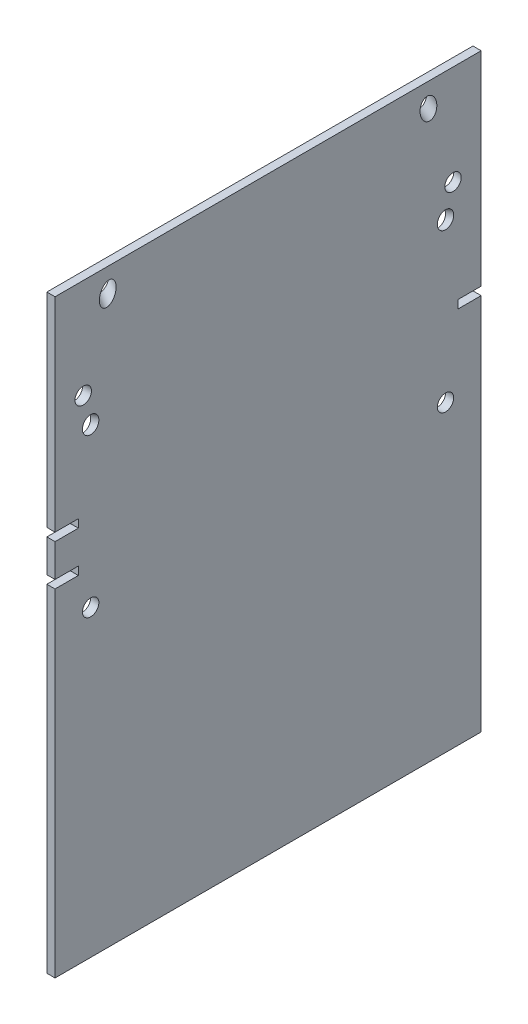
ISO-10303-21;
HEADER;
FILE_DESCRIPTION(('STEP AP214'),'2;1');
FILE_NAME('part.step','',(''),(''),'','','');
FILE_SCHEMA(('AUTOMOTIVE_DESIGN { 1 0 10303 214 1 1 1 1 }'));
ENDSEC;
DATA;
#1=APPLICATION_CONTEXT('core data for automotive mechanical design processes');
#2=APPLICATION_PROTOCOL_DEFINITION('international standard','automotive_design',2000,#1);
#3=PRODUCT_CONTEXT('',#1,'mechanical');
#4=PRODUCT('Part','Part','',(#3));
#5=PRODUCT_RELATED_PRODUCT_CATEGORY('part','',(#4));
#6=PRODUCT_DEFINITION_FORMATION('','',#4);
#7=PRODUCT_DEFINITION_CONTEXT('part definition',#1,'design');
#8=PRODUCT_DEFINITION('design','',#6,#7);
#9=PRODUCT_DEFINITION_SHAPE('','',#8);
#10=(LENGTH_UNIT() NAMED_UNIT(*) SI_UNIT(.MILLI.,.METRE.));
#11=(NAMED_UNIT(*) PLANE_ANGLE_UNIT() SI_UNIT($,.RADIAN.));
#12=(NAMED_UNIT(*) SI_UNIT($,.STERADIAN.) SOLID_ANGLE_UNIT());
#13=UNCERTAINTY_MEASURE_WITH_UNIT(LENGTH_MEASURE(1.E-05),#10,'distance_accuracy_value','');
#14=(GEOMETRIC_REPRESENTATION_CONTEXT(3) GLOBAL_UNCERTAINTY_ASSIGNED_CONTEXT((#13)) GLOBAL_UNIT_ASSIGNED_CONTEXT((#10,
#11,#12)) REPRESENTATION_CONTEXT('',''));
#15=CARTESIAN_POINT('',(0.,0.,0.));
#16=DIRECTION('',(0.,0.,1.));
#17=DIRECTION('',(1.,0.,0.));
#18=AXIS2_PLACEMENT_3D('',#15,#16,#17);
#19=CARTESIAN_POINT('',(2463.8,444.5,330.2));
#20=DIRECTION('',(0.,0.,-1.));
#21=DIRECTION('',(-1.,0.,0.));
#22=AXIS2_PLACEMENT_3D('',#19,#20,#21);
#23=PLANE('',#22);
#24=DIRECTION('',(0.,-1.,0.));
#25=VECTOR('',#24,1.);
#26=CARTESIAN_POINT('',(2463.8,444.5,330.2));
#27=LINE('',#26,#25);
#28=CARTESIAN_POINT('',(2463.8,115.8,330.2));
#29=VERTEX_POINT('',#28);
#30=CARTESIAN_POINT('',(2463.8,64.9999999999999,330.2));
#31=VERTEX_POINT('',#30);
#32=EDGE_CURVE('E189',#29,#31,#27,.T.);
#33=ORIENTED_EDGE('',*,*,#32,.T.);
#34=DIRECTION('',(1.,0.,0.));
#35=VECTOR('',#34,1.);
#36=CARTESIAN_POINT('',(2463.8,64.9999999999999,330.2));
#37=LINE('',#36,#35);
#38=CARTESIAN_POINT('',(2476.5,64.9999999999999,330.2));
#39=VERTEX_POINT('',#38);
#40=EDGE_CURVE('E332',#31,#39,#37,.T.);
#41=ORIENTED_EDGE('',*,*,#40,.T.);
#42=DIRECTION('',(0.,-1.,0.));
#43=VECTOR('',#42,1.);
#44=CARTESIAN_POINT('',(2476.5,444.5,330.2));
#45=LINE('',#44,#43);
#46=CARTESIAN_POINT('',(2476.5,115.8,330.2));
#47=VERTEX_POINT('',#46);
#48=EDGE_CURVE('E170',#47,#39,#45,.T.);
#49=ORIENTED_EDGE('',*,*,#48,.F.);
#50=DIRECTION('',(-1.,0.,0.));
#51=VECTOR('',#50,1.);
#52=CARTESIAN_POINT('',(2463.8,115.8,330.2));
#53=LINE('',#52,#51);
#54=EDGE_CURVE('E299',#47,#29,#53,.T.);
#55=ORIENTED_EDGE('',*,*,#54,.T.);
#56=EDGE_LOOP('',(#33,#41,#49,#55));
#57=FACE_BOUND('',#56,.T.);
#58=ADVANCED_FACE('F37',(#57),#23,.F.);
#59=CARTESIAN_POINT('',(2463.8,444.5,-330.2));
#60=DIRECTION('',(0.,0.,1.));
#61=DIRECTION('',(1.,0.,0.));
#62=AXIS2_PLACEMENT_3D('',#59,#60,#61);
#63=PLANE('',#62);
#64=DIRECTION('',(0.,-1.,0.));
#65=VECTOR('',#64,1.);
#66=CARTESIAN_POINT('',(2463.8,444.5,-330.2));
#67=LINE('',#66,#65);
#68=CARTESIAN_POINT('',(2463.8,115.8,-330.2));
#69=VERTEX_POINT('',#68);
#70=CARTESIAN_POINT('',(2463.8,-469.9,-330.2));
#71=VERTEX_POINT('',#70);
#72=EDGE_CURVE('E258',#69,#71,#67,.T.);
#73=ORIENTED_EDGE('',*,*,#72,.F.);
#74=DIRECTION('',(1.,0.,0.));
#75=VECTOR('',#74,1.);
#76=CARTESIAN_POINT('',(2463.8,115.8,-330.2));
#77=LINE('',#76,#75);
#78=CARTESIAN_POINT('',(2476.5,115.8,-330.2));
#79=VERTEX_POINT('',#78);
#80=EDGE_CURVE('E230',#69,#79,#77,.T.);
#81=ORIENTED_EDGE('',*,*,#80,.T.);
#82=DIRECTION('',(0.,-1.,0.));
#83=VECTOR('',#82,1.);
#84=CARTESIAN_POINT('',(2476.5,444.5,-330.2));
#85=LINE('',#84,#83);
#86=CARTESIAN_POINT('',(2476.5,-469.9,-330.2));
#87=VERTEX_POINT('',#86);
#88=EDGE_CURVE('E256',#79,#87,#85,.T.);
#89=ORIENTED_EDGE('',*,*,#88,.T.);
#90=DIRECTION('',(-1.,0.,0.));
#91=VECTOR('',#90,1.);
#92=CARTESIAN_POINT('',(2463.8,-469.9,-330.2));
#93=LINE('',#92,#91);
#94=EDGE_CURVE('E180',#87,#71,#93,.T.);
#95=ORIENTED_EDGE('',*,*,#94,.T.);
#96=EDGE_LOOP('',(#73,#81,#89,#95));
#97=FACE_BOUND('',#96,.T.);
#98=ADVANCED_FACE('F353',(#97),#63,.F.);
#99=CARTESIAN_POINT('',(2463.8,444.5,330.2));
#100=VERTEX_POINT('',#99);
#101=CARTESIAN_POINT('',(2463.8,128.5,330.2));
#102=VERTEX_POINT('',#101);
#103=EDGE_CURVE('E186',#100,#102,#27,.T.);
#104=ORIENTED_EDGE('',*,*,#103,.T.);
#105=DIRECTION('',(1.,0.,0.));
#106=VECTOR('',#105,1.);
#107=CARTESIAN_POINT('',(2463.8,128.5,330.2));
#108=LINE('',#107,#106);
#109=CARTESIAN_POINT('',(2476.5,128.5,330.2));
#110=VERTEX_POINT('',#109);
#111=EDGE_CURVE('E267',#102,#110,#108,.T.);
#112=ORIENTED_EDGE('',*,*,#111,.T.);
#113=CARTESIAN_POINT('',(2476.5,444.5,330.2));
#114=VERTEX_POINT('',#113);
#115=EDGE_CURVE('E176',#114,#110,#45,.T.);
#116=ORIENTED_EDGE('',*,*,#115,.F.);
#117=DIRECTION('',(1.,0.,0.));
#118=VECTOR('',#117,1.);
#119=CARTESIAN_POINT('',(2463.8,444.5,330.2));
#120=LINE('',#119,#118);
#121=EDGE_CURVE('E273',#100,#114,#120,.T.);
#122=ORIENTED_EDGE('',*,*,#121,.F.);
#123=EDGE_LOOP('',(#104,#112,#116,#122));
#124=FACE_BOUND('',#123,.T.);
#125=ADVANCED_FACE('F355',(#124),#23,.F.);
#126=CARTESIAN_POINT('',(2463.8,444.5,-330.2));
#127=DIRECTION('',(1.,0.,0.));
#128=DIRECTION('',(0.,0.,-1.));
#129=AXIS2_PLACEMENT_3D('',#126,#127,#128);
#130=PLANE('',#129);
#131=DIRECTION('',(0.,1.,0.));
#132=VECTOR('',#131,1.);
#133=CARTESIAN_POINT('',(2463.8,52.3,294.05));
#134=LINE('',#133,#132);
#135=CARTESIAN_POINT('',(2463.8,52.3,294.05));
#136=VERTEX_POINT('',#135);
#137=CARTESIAN_POINT('',(2463.8,65.,294.05));
#138=VERTEX_POINT('',#137);
#139=EDGE_CURVE('E163',#136,#138,#134,.T.);
#140=ORIENTED_EDGE('',*,*,#139,.T.);
#141=DIRECTION('',(0.,0.,1.));
#142=VECTOR('',#141,1.);
#143=CARTESIAN_POINT('',(2463.8,64.9999999999999,-330.2));
#144=LINE('',#143,#142);
#145=EDGE_CURVE('E162',#138,#31,#144,.T.);
#146=ORIENTED_EDGE('',*,*,#145,.T.);
#147=ORIENTED_EDGE('',*,*,#32,.F.);
#148=DIRECTION('',(0.,0.,-1.));
#149=VECTOR('',#148,1.);
#150=CARTESIAN_POINT('',(2463.8,115.8,-330.2));
#151=LINE('',#150,#149);
#152=CARTESIAN_POINT('',(2463.8,115.8,294.05));
#153=VERTEX_POINT('',#152);
#154=EDGE_CURVE('E296',#29,#153,#151,.T.);
#155=ORIENTED_EDGE('',*,*,#154,.T.);
#156=DIRECTION('',(0.,1.,0.));
#157=VECTOR('',#156,1.);
#158=CARTESIAN_POINT('',(2463.8,115.8,294.05));
#159=LINE('',#158,#157);
#160=CARTESIAN_POINT('',(2463.8,128.5,294.05));
#161=VERTEX_POINT('',#160);
#162=EDGE_CURVE('E301',#153,#161,#159,.T.);
#163=ORIENTED_EDGE('',*,*,#162,.T.);
#164=DIRECTION('',(0.,0.,1.));
#165=VECTOR('',#164,1.);
#166=CARTESIAN_POINT('',(2463.8,128.5,-330.2));
#167=LINE('',#166,#165);
#168=EDGE_CURVE('E265',#161,#102,#167,.T.);
#169=ORIENTED_EDGE('',*,*,#168,.T.);
#170=ORIENTED_EDGE('',*,*,#103,.F.);
#171=DIRECTION('',(0.,0.,1.));
#172=VECTOR('',#171,1.);
#173=CARTESIAN_POINT('',(2463.8,444.5,-330.2));
#174=LINE('',#173,#172);
#175=CARTESIAN_POINT('',(2463.8,444.5,-330.2));
#176=VERTEX_POINT('',#175);
#177=EDGE_CURVE('E275',#176,#100,#174,.T.);
#178=ORIENTED_EDGE('',*,*,#177,.F.);
#179=CARTESIAN_POINT('',(2463.8,128.5,-330.2));
#180=VERTEX_POINT('',#179);
#181=EDGE_CURVE('E247',#176,#180,#67,.T.);
#182=ORIENTED_EDGE('',*,*,#181,.T.);
#183=DIRECTION('',(0.,0.,1.));
#184=VECTOR('',#183,1.);
#185=CARTESIAN_POINT('',(2463.8,128.5,-330.2));
#186=LINE('',#185,#184);
#187=CARTESIAN_POINT('',(2463.8,128.5,-294.050000000001));
#188=VERTEX_POINT('',#187);
#189=EDGE_CURVE('E60',#180,#188,#186,.T.);
#190=ORIENTED_EDGE('',*,*,#189,.T.);
#191=DIRECTION('',(0.,-1.,0.));
#192=VECTOR('',#191,1.);
#193=CARTESIAN_POINT('',(2463.8,128.5,-294.050000000001));
#194=LINE('',#193,#192);
#195=CARTESIAN_POINT('',(2463.8,115.8,-294.050000000001));
#196=VERTEX_POINT('',#195);
#197=EDGE_CURVE('E320',#188,#196,#194,.T.);
#198=ORIENTED_EDGE('',*,*,#197,.T.);
#199=DIRECTION('',(0.,0.,-1.));
#200=VECTOR('',#199,1.);
#201=CARTESIAN_POINT('',(2463.8,115.8,-330.2));
#202=LINE('',#201,#200);
#203=EDGE_CURVE('E305',#196,#69,#202,.T.);
#204=ORIENTED_EDGE('',*,*,#203,.T.);
#205=ORIENTED_EDGE('',*,*,#72,.T.);
#206=DIRECTION('',(0.,0.,1.));
#207=VECTOR('',#206,1.);
#208=CARTESIAN_POINT('',(2463.8,-469.9,-330.2));
#209=LINE('',#208,#207);
#210=CARTESIAN_POINT('',(2463.8,-469.9,330.2));
#211=VERTEX_POINT('',#210);
#212=EDGE_CURVE('E262',#71,#211,#209,.T.);
#213=ORIENTED_EDGE('',*,*,#212,.T.);
#214=CARTESIAN_POINT('',(2463.8,52.3,330.2));
#215=VERTEX_POINT('',#214);
#216=EDGE_CURVE('E190',#215,#211,#27,.T.);
#217=ORIENTED_EDGE('',*,*,#216,.F.);
#218=DIRECTION('',(0.,0.,-1.));
#219=VECTOR('',#218,1.);
#220=CARTESIAN_POINT('',(2463.8,52.3,-330.2));
#221=LINE('',#220,#219);
#222=EDGE_CURVE('E334',#215,#136,#221,.T.);
#223=ORIENTED_EDGE('',*,*,#222,.T.);
#224=EDGE_LOOP('',(#140,#146,#147,#155,#163,#169,#170,#178,#182,#190,#198,#204,#205,#213,#217,#223));
#225=FACE_BOUND('',#224,.T.);
#226=CARTESIAN_POINT('',(2463.8,240.627500000009,-275.000000000001));
#227=DIRECTION('',(1.,0.,0.));
#228=DIRECTION('',(0.,1.,0.));
#229=AXIS2_PLACEMENT_3D('',#226,#227,#228);
#230=ELLIPSE('',#229,13.5086829136855,12.7);
#231=CARTESIAN_POINT('',(2463.8,254.136182913695,-275.000000000001));
#232=VERTEX_POINT('',#231);
#233=EDGE_CURVE('E204',#232,#232,#230,.F.);
#234=ORIENTED_EDGE('',*,*,#233,.F.);
#235=EDGE_LOOP('',(#234));
#236=FACE_BOUND('',#235,.T.);
#237=CARTESIAN_POINT('',(2463.8,-7.12133119048504E-13,-275.000000000001));
#238=DIRECTION('',(1.,0.,0.));
#239=DIRECTION('',(0.,0.,-1.));
#240=AXIS2_PLACEMENT_3D('',#237,#238,#239);
#241=CIRCLE('',#240,12.7);
#242=CARTESIAN_POINT('',(2463.8,-7.12133119048504E-13,-287.700000000001));
#243=VERTEX_POINT('',#242);
#244=EDGE_CURVE('E208',#243,#243,#241,.F.);
#245=ORIENTED_EDGE('',*,*,#244,.F.);
#246=EDGE_LOOP('',(#245));
#247=FACE_BOUND('',#246,.T.);
#248=CARTESIAN_POINT('',(2463.8,289.999999999994,-287.768749999998));
#249=DIRECTION('',(1.,0.,0.));
#250=DIRECTION('',(0.,-1.68753899743025E-13,-1.));
#251=AXIS2_PLACEMENT_3D('',#248,#249,#250);
#252=ELLIPSE('',#251,12.7556884522406,12.7);
#253=CARTESIAN_POINT('',(2463.8,289.999999999991,-300.524438452238));
#254=VERTEX_POINT('',#253);
#255=EDGE_CURVE('E212',#254,#254,#252,.F.);
#256=ORIENTED_EDGE('',*,*,#255,.F.);
#257=EDGE_LOOP('',(#256));
#258=FACE_BOUND('',#257,.T.);
#259=CARTESIAN_POINT('',(2463.8,419.804647774969,-245.782156472755));
#260=DIRECTION('',(1.,0.,0.));
#261=DIRECTION('',(0.,0.975590762994734,0.219596591866432));
#262=AXIS2_PLACEMENT_3D('',#259,#260,#261);
#263=ELLIPSE('',#262,17.7541873688823,12.7000000000001);
#264=CARTESIAN_POINT('',(2463.8,437.125468976528,-241.88339743519));
#265=VERTEX_POINT('',#264);
#266=EDGE_CURVE('E216',#265,#265,#263,.F.);
#267=ORIENTED_EDGE('',*,*,#266,.F.);
#268=EDGE_LOOP('',(#267));
#269=FACE_BOUND('',#268,.T.);
#270=CARTESIAN_POINT('',(2463.8,419.804647774969,245.782156472754));
#271=DIRECTION('',(1.,0.,0.));
#272=DIRECTION('',(0.,-0.975590762994734,0.219596591866431));
#273=AXIS2_PLACEMENT_3D('',#270,#271,#272);
#274=ELLIPSE('',#273,17.7541873688822,12.7);
#275=CARTESIAN_POINT('',(2463.8,402.48382657341,249.680915510319));
#276=VERTEX_POINT('',#275);
#277=EDGE_CURVE('E220',#276,#276,#274,.F.);
#278=ORIENTED_EDGE('',*,*,#277,.F.);
#279=EDGE_LOOP('',(#278));
#280=FACE_BOUND('',#279,.T.);
#281=CARTESIAN_POINT('',(2463.8,240.627500000009,275.));
#282=DIRECTION('',(1.,0.,0.));
#283=DIRECTION('',(0.,-1.,0.));
#284=AXIS2_PLACEMENT_3D('',#281,#282,#283);
#285=ELLIPSE('',#284,13.5086829136855,12.7);
#286=CARTESIAN_POINT('',(2463.8,227.118817086323,275.));
#287=VERTEX_POINT('',#286);
#288=EDGE_CURVE('E203',#287,#287,#285,.F.);
#289=ORIENTED_EDGE('',*,*,#288,.F.);
#290=EDGE_LOOP('',(#289));
#291=FACE_BOUND('',#290,.T.);
#292=CARTESIAN_POINT('',(2463.8,-4.18286707223905E-12,275.));
#293=DIRECTION('',(1.,0.,0.));
#294=DIRECTION('',(0.,0.,-1.));
#295=AXIS2_PLACEMENT_3D('',#292,#293,#294);
#296=CIRCLE('',#295,12.7);
#297=CARTESIAN_POINT('',(2463.8,-4.18286707223905E-12,262.3));
#298=VERTEX_POINT('',#297);
#299=EDGE_CURVE('E199',#298,#298,#296,.F.);
#300=ORIENTED_EDGE('',*,*,#299,.F.);
#301=EDGE_LOOP('',(#300));
#302=FACE_BOUND('',#301,.T.);
#303=CARTESIAN_POINT('',(2463.8,289.999999999994,287.768749999997));
#304=DIRECTION('',(1.,0.,0.));
#305=DIRECTION('',(0.,-1.70234197109192E-13,1.));
#306=AXIS2_PLACEMENT_3D('',#303,#304,#305);
#307=ELLIPSE('',#306,12.7556884522406,12.7);
#308=CARTESIAN_POINT('',(2463.8,289.999999999991,300.524438452237));
#309=VERTEX_POINT('',#308);
#310=EDGE_CURVE('E194',#309,#309,#307,.F.);
#311=ORIENTED_EDGE('',*,*,#310,.F.);
#312=EDGE_LOOP('',(#311));
#313=FACE_BOUND('',#312,.T.);
#314=ADVANCED_FACE('F39',(#225,#236,#247,#258,#269,#280,#291,#302,#313),#130,.F.);
#315=CARTESIAN_POINT('',(2476.5,52.3,330.2));
#316=VERTEX_POINT('',#315);
#317=CARTESIAN_POINT('',(2476.5,-469.9,330.2));
#318=VERTEX_POINT('',#317);
#319=EDGE_CURVE('E177',#316,#318,#45,.T.);
#320=ORIENTED_EDGE('',*,*,#319,.F.);
#321=DIRECTION('',(-1.,0.,0.));
#322=VECTOR('',#321,1.);
#323=CARTESIAN_POINT('',(2463.8,52.3,330.2));
#324=LINE('',#323,#322);
#325=EDGE_CURVE('E239',#316,#215,#324,.T.);
#326=ORIENTED_EDGE('',*,*,#325,.T.);
#327=ORIENTED_EDGE('',*,*,#216,.T.);
#328=DIRECTION('',(1.,0.,0.));
#329=VECTOR('',#328,1.);
#330=CARTESIAN_POINT('',(2463.8,-469.9,330.2));
#331=LINE('',#330,#329);
#332=EDGE_CURVE('E242',#211,#318,#331,.T.);
#333=ORIENTED_EDGE('',*,*,#332,.T.);
#334=EDGE_LOOP('',(#320,#326,#327,#333));
#335=FACE_BOUND('',#334,.T.);
#336=ADVANCED_FACE('F238',(#335),#23,.F.);
#337=CARTESIAN_POINT('',(2476.5,444.5,-330.2));
#338=DIRECTION('',(-1.,0.,0.));
#339=DIRECTION('',(0.,0.,1.));
#340=AXIS2_PLACEMENT_3D('',#337,#338,#339);
#341=PLANE('',#340);
#342=DIRECTION('',(0.,1.,0.));
#343=VECTOR('',#342,1.);
#344=CARTESIAN_POINT('',(2476.5,52.3,294.05));
#345=LINE('',#344,#343);
#346=CARTESIAN_POINT('',(2476.5,52.3,294.05));
#347=VERTEX_POINT('',#346);
#348=CARTESIAN_POINT('',(2476.5,65.,294.05));
#349=VERTEX_POINT('',#348);
#350=EDGE_CURVE('E150',#347,#349,#345,.T.);
#351=ORIENTED_EDGE('',*,*,#350,.F.);
#352=DIRECTION('',(0.,0.,1.));
#353=VECTOR('',#352,1.);
#354=CARTESIAN_POINT('',(2476.5,52.3,-330.2));
#355=LINE('',#354,#353);
#356=EDGE_CURVE('E45',#347,#316,#355,.T.);
#357=ORIENTED_EDGE('',*,*,#356,.T.);
#358=ORIENTED_EDGE('',*,*,#319,.T.);
#359=DIRECTION('',(0.,0.,-1.));
#360=VECTOR('',#359,1.);
#361=CARTESIAN_POINT('',(2476.5,-469.9,-330.2));
#362=LINE('',#361,#360);
#363=EDGE_CURVE('E181',#318,#87,#362,.T.);
#364=ORIENTED_EDGE('',*,*,#363,.T.);
#365=ORIENTED_EDGE('',*,*,#88,.F.);
#366=DIRECTION('',(0.,0.,1.));
#367=VECTOR('',#366,1.);
#368=CARTESIAN_POINT('',(2476.5,115.8,-330.2));
#369=LINE('',#368,#367);
#370=CARTESIAN_POINT('',(2476.5,115.8,-294.050000000001));
#371=VERTEX_POINT('',#370);
#372=EDGE_CURVE('E313',#79,#371,#369,.T.);
#373=ORIENTED_EDGE('',*,*,#372,.T.);
#374=DIRECTION('',(0.,-1.,0.));
#375=VECTOR('',#374,1.);
#376=CARTESIAN_POINT('',(2476.5,128.5,-294.050000000001));
#377=LINE('',#376,#375);
#378=CARTESIAN_POINT('',(2476.5,128.5,-294.050000000001));
#379=VERTEX_POINT('',#378);
#380=EDGE_CURVE('E324',#379,#371,#377,.T.);
#381=ORIENTED_EDGE('',*,*,#380,.F.);
#382=DIRECTION('',(0.,0.,-1.));
#383=VECTOR('',#382,1.);
#384=CARTESIAN_POINT('',(2476.5,128.5,-330.2));
#385=LINE('',#384,#383);
#386=CARTESIAN_POINT('',(2476.5,128.5,-330.2));
#387=VERTEX_POINT('',#386);
#388=EDGE_CURVE('E317',#379,#387,#385,.T.);
#389=ORIENTED_EDGE('',*,*,#388,.T.);
#390=CARTESIAN_POINT('',(2476.5,444.5,-330.2));
#391=VERTEX_POINT('',#390);
#392=EDGE_CURVE('E184',#391,#387,#85,.T.);
#393=ORIENTED_EDGE('',*,*,#392,.F.);
#394=DIRECTION('',(0.,0.,-1.));
#395=VECTOR('',#394,1.);
#396=CARTESIAN_POINT('',(2476.5,444.5,-330.2));
#397=LINE('',#396,#395);
#398=EDGE_CURVE('E271',#114,#391,#397,.T.);
#399=ORIENTED_EDGE('',*,*,#398,.F.);
#400=ORIENTED_EDGE('',*,*,#115,.T.);
#401=DIRECTION('',(0.,0.,-1.));
#402=VECTOR('',#401,1.);
#403=CARTESIAN_POINT('',(2476.5,128.5,-330.2));
#404=LINE('',#403,#402);
#405=CARTESIAN_POINT('',(2476.5,128.5,294.05));
#406=VERTEX_POINT('',#405);
#407=EDGE_CURVE('E225',#110,#406,#404,.T.);
#408=ORIENTED_EDGE('',*,*,#407,.T.);
#409=DIRECTION('',(0.,1.,0.));
#410=VECTOR('',#409,1.);
#411=CARTESIAN_POINT('',(2476.5,115.8,294.05));
#412=LINE('',#411,#410);
#413=CARTESIAN_POINT('',(2476.5,115.8,294.05));
#414=VERTEX_POINT('',#413);
#415=EDGE_CURVE('E304',#414,#406,#412,.T.);
#416=ORIENTED_EDGE('',*,*,#415,.F.);
#417=DIRECTION('',(0.,0.,1.));
#418=VECTOR('',#417,1.);
#419=CARTESIAN_POINT('',(2476.5,115.8,-330.2));
#420=LINE('',#419,#418);
#421=EDGE_CURVE('E173',#414,#47,#420,.T.);
#422=ORIENTED_EDGE('',*,*,#421,.T.);
#423=ORIENTED_EDGE('',*,*,#48,.T.);
#424=DIRECTION('',(0.,0.,-1.));
#425=VECTOR('',#424,1.);
#426=CARTESIAN_POINT('',(2476.5,64.9999999999999,-330.2));
#427=LINE('',#426,#425);
#428=EDGE_CURVE('E11',#39,#349,#427,.T.);
#429=ORIENTED_EDGE('',*,*,#428,.T.);
#430=EDGE_LOOP('',(#351,#357,#358,#364,#365,#373,#381,#389,#393,#399,#400,#408,#416,#422,#423,#429));
#431=FACE_BOUND('',#430,.T.);
#432=CARTESIAN_POINT('',(2476.5,245.231250000009,-275.000000000001));
#433=DIRECTION('',(-1.,0.,0.));
#434=DIRECTION('',(0.,1.,0.));
#435=AXIS2_PLACEMENT_3D('',#432,#433,#434);
#436=ELLIPSE('',#435,13.5086829136855,12.7);
#437=CARTESIAN_POINT('',(2476.5,258.739932913695,-275.000000000001));
#438=VERTEX_POINT('',#437);
#439=EDGE_CURVE('E207',#438,#438,#436,.F.);
#440=ORIENTED_EDGE('',*,*,#439,.F.);
#441=EDGE_LOOP('',(#440));
#442=FACE_BOUND('',#441,.T.);
#443=CARTESIAN_POINT('',(2476.5,-6.45730104276708E-13,-275.000000000001));
#444=DIRECTION('',(-1.,0.,0.));
#445=DIRECTION('',(0.,0.,1.));
#446=AXIS2_PLACEMENT_3D('',#443,#444,#445);
#447=CIRCLE('',#446,12.7);
#448=CARTESIAN_POINT('',(2476.5,-6.45730104276708E-13,-262.300000000001));
#449=VERTEX_POINT('',#448);
#450=EDGE_CURVE('E211',#449,#449,#447,.F.);
#451=ORIENTED_EDGE('',*,*,#450,.F.);
#452=EDGE_LOOP('',(#451));
#453=FACE_BOUND('',#452,.T.);
#454=CARTESIAN_POINT('',(2476.5,289.999999999994,-286.578124999997));
#455=DIRECTION('',(-1.,0.,0.));
#456=DIRECTION('',(0.,-1.68753899743025E-13,-1.));
#457=AXIS2_PLACEMENT_3D('',#454,#455,#456);
#458=ELLIPSE('',#457,12.7556884522406,12.7);
#459=CARTESIAN_POINT('',(2476.5,289.999999999992,-299.333813452238));
#460=VERTEX_POINT('',#459);
#461=EDGE_CURVE('E215',#460,#460,#458,.F.);
#462=ORIENTED_EDGE('',*,*,#461,.F.);
#463=EDGE_LOOP('',(#462));
#464=FACE_BOUND('',#463,.T.);
#465=CARTESIAN_POINT('',(2476.5,407.700983848811,-248.506580942624));
#466=DIRECTION('',(-1.,0.,0.));
#467=DIRECTION('',(0.,0.975590762994734,0.219596591866432));
#468=AXIS2_PLACEMENT_3D('',#465,#466,#467);
#469=ELLIPSE('',#468,17.7541873688823,12.7000000000001);
#470=CARTESIAN_POINT('',(2476.5,425.021805050371,-244.607821905059));
#471=VERTEX_POINT('',#470);
#472=EDGE_CURVE('E219',#471,#471,#469,.F.);
#473=ORIENTED_EDGE('',*,*,#472,.F.);
#474=EDGE_LOOP('',(#473));
#475=FACE_BOUND('',#474,.T.);
#476=CARTESIAN_POINT('',(2476.5,407.700983848812,248.506580942623));
#477=DIRECTION('',(-1.,0.,0.));
#478=DIRECTION('',(0.,-0.975590762994734,0.219596591866431));
#479=AXIS2_PLACEMENT_3D('',#476,#477,#478);
#480=ELLIPSE('',#479,17.7541873688822,12.7);
#481=CARTESIAN_POINT('',(2476.5,390.380162647253,252.405339980188));
#482=VERTEX_POINT('',#481);
#483=EDGE_CURVE('E223',#482,#482,#480,.F.);
#484=ORIENTED_EDGE('',*,*,#483,.F.);
#485=EDGE_LOOP('',(#484));
#486=FACE_BOUND('',#485,.T.);
#487=CARTESIAN_POINT('',(2476.5,245.231250000009,275.));
#488=DIRECTION('',(-1.,0.,0.));
#489=DIRECTION('',(0.,-1.,0.));
#490=AXIS2_PLACEMENT_3D('',#487,#488,#489);
#491=ELLIPSE('',#490,13.5086829136855,12.7);
#492=CARTESIAN_POINT('',(2476.5,231.722567086323,275.));
#493=VERTEX_POINT('',#492);
#494=EDGE_CURVE('E200',#493,#493,#491,.F.);
#495=ORIENTED_EDGE('',*,*,#494,.F.);
#496=EDGE_LOOP('',(#495));
#497=FACE_BOUND('',#496,.T.);
#498=CARTESIAN_POINT('',(2476.5,-4.18286707223905E-12,275.));
#499=DIRECTION('',(-1.,0.,0.));
#500=DIRECTION('',(0.,0.,1.));
#501=AXIS2_PLACEMENT_3D('',#498,#499,#500);
#502=CIRCLE('',#501,12.7);
#503=CARTESIAN_POINT('',(2476.5,-4.18286707223905E-12,287.7));
#504=VERTEX_POINT('',#503);
#505=EDGE_CURVE('E196',#504,#504,#502,.F.);
#506=ORIENTED_EDGE('',*,*,#505,.F.);
#507=EDGE_LOOP('',(#506));
#508=FACE_BOUND('',#507,.T.);
#509=CARTESIAN_POINT('',(2476.5,289.999999999994,286.578124999997));
#510=DIRECTION('',(-1.,0.,0.));
#511=DIRECTION('',(0.,-1.70234197109192E-13,1.));
#512=AXIS2_PLACEMENT_3D('',#509,#510,#511);
#513=ELLIPSE('',#512,12.7556884522406,12.7);
#514=CARTESIAN_POINT('',(2476.5,289.999999999992,299.333813452237));
#515=VERTEX_POINT('',#514);
#516=EDGE_CURVE('E191',#515,#515,#513,.F.);
#517=ORIENTED_EDGE('',*,*,#516,.F.);
#518=EDGE_LOOP('',(#517));
#519=FACE_BOUND('',#518,.T.);
#520=ADVANCED_FACE('F166',(#431,#442,#453,#464,#475,#486,#497,#508,#519),#341,.F.);
#521=ORIENTED_EDGE('',*,*,#392,.T.);
#522=DIRECTION('',(-1.,0.,0.));
#523=VECTOR('',#522,1.);
#524=CARTESIAN_POINT('',(2463.8,128.5,-330.2));
#525=LINE('',#524,#523);
#526=EDGE_CURVE('E228',#387,#180,#525,.T.);
#527=ORIENTED_EDGE('',*,*,#526,.T.);
#528=ORIENTED_EDGE('',*,*,#181,.F.);
#529=DIRECTION('',(-1.,0.,0.));
#530=VECTOR('',#529,1.);
#531=CARTESIAN_POINT('',(2463.8,444.5,-330.2));
#532=LINE('',#531,#530);
#533=EDGE_CURVE('E195',#391,#176,#532,.T.);
#534=ORIENTED_EDGE('',*,*,#533,.F.);
#535=EDGE_LOOP('',(#521,#527,#528,#534));
#536=FACE_BOUND('',#535,.T.);
#537=ADVANCED_FACE('F361',(#536),#63,.F.);
#538=CARTESIAN_POINT('',(0.,444.5,0.));
#539=DIRECTION('',(0.,1.,0.));
#540=DIRECTION('',(0.,0.,1.));
#541=AXIS2_PLACEMENT_3D('',#538,#539,#540);
#542=PLANE('',#541);
#543=ORIENTED_EDGE('',*,*,#177,.T.);
#544=ORIENTED_EDGE('',*,*,#121,.T.);
#545=ORIENTED_EDGE('',*,*,#398,.T.);
#546=ORIENTED_EDGE('',*,*,#533,.T.);
#547=EDGE_LOOP('',(#543,#544,#545,#546));
#548=FACE_BOUND('',#547,.T.);
#549=ADVANCED_FACE('F399',(#548),#542,.T.);
#550=CARTESIAN_POINT('',(0.,-469.9,0.));
#551=DIRECTION('',(0.,1.,0.));
#552=DIRECTION('',(0.,0.,1.));
#553=AXIS2_PLACEMENT_3D('',#550,#551,#552);
#554=PLANE('',#553);
#555=ORIENTED_EDGE('',*,*,#212,.F.);
#556=ORIENTED_EDGE('',*,*,#94,.F.);
#557=ORIENTED_EDGE('',*,*,#363,.F.);
#558=ORIENTED_EDGE('',*,*,#332,.F.);
#559=EDGE_LOOP('',(#555,#556,#557,#558));
#560=FACE_BOUND('',#559,.T.);
#561=ADVANCED_FACE('F250',(#560),#554,.F.);
#562=CARTESIAN_POINT('',(2599.99999999996,289.999999999996,275.));
#563=DIRECTION('',(-0.995634226059288,0.,0.0933407086930576));
#564=DIRECTION('',(0.0933407086930577,0.,0.995634226059288));
#565=AXIS2_PLACEMENT_3D('',#562,#563,#564);
#566=CYLINDRICAL_SURFACE('',#565,12.7);
#567=ORIENTED_EDGE('',*,*,#516,.T.);
#568=EDGE_LOOP('',(#567));
#569=FACE_BOUND('',#568,.T.);
#570=ORIENTED_EDGE('',*,*,#310,.T.);
#571=EDGE_LOOP('',(#570));
#572=FACE_BOUND('',#571,.T.);
#573=ADVANCED_FACE('F496',(#569,#572),#566,.F.);
#574=CARTESIAN_POINT('',(2599.99999999996,-4.18286707223905E-12,275.));
#575=DIRECTION('',(-1.,0.,0.));
#576=DIRECTION('',(0.,0.,1.));
#577=AXIS2_PLACEMENT_3D('',#574,#575,#576);
#578=CYLINDRICAL_SURFACE('',#577,12.7);
#579=ORIENTED_EDGE('',*,*,#505,.T.);
#580=EDGE_LOOP('',(#579));
#581=FACE_BOUND('',#580,.T.);
#582=ORIENTED_EDGE('',*,*,#299,.T.);
#583=EDGE_LOOP('',(#582));
#584=FACE_BOUND('',#583,.T.);
#585=ADVANCED_FACE('F505',(#581,#584),#578,.F.);
#586=CARTESIAN_POINT('',(2599.99999999996,289.999999999996,275.));
#587=DIRECTION('',(-0.940136065162483,-0.3407993236214,0.));
#588=DIRECTION('',(0.3407993236214,-0.940136065162483,0.));
#589=AXIS2_PLACEMENT_3D('',#586,#587,#588);
#590=CYLINDRICAL_SURFACE('',#589,12.7);
#591=ORIENTED_EDGE('',*,*,#494,.T.);
#592=EDGE_LOOP('',(#591));
#593=FACE_BOUND('',#592,.T.);
#594=ORIENTED_EDGE('',*,*,#288,.T.);
#595=EDGE_LOOP('',(#594));
#596=FACE_BOUND('',#595,.T.);
#597=ADVANCED_FACE('F515',(#593,#596),#590,.F.);
#598=CARTESIAN_POINT('',(1799.99999999996,1052.43552290753,103.38271055945));
#599=DIRECTION('',(0.715324206967608,-0.681735732234708,0.153452501838741));
#600=DIRECTION('',(0.689906973200086,0.723898037246887,0.));
#601=AXIS2_PLACEMENT_3D('',#598,#599,#600);
#602=CYLINDRICAL_SURFACE('',#601,12.7);
#603=ORIENTED_EDGE('',*,*,#483,.T.);
#604=EDGE_LOOP('',(#603));
#605=FACE_BOUND('',#604,.T.);
#606=ORIENTED_EDGE('',*,*,#277,.T.);
#607=EDGE_LOOP('',(#606));
#608=FACE_BOUND('',#607,.T.);
#609=ADVANCED_FACE('F525',(#605,#608),#602,.F.);
#610=CARTESIAN_POINT('',(2599.99999999996,289.999999999996,-275.000000000001));
#611=DIRECTION('',(-0.715324206967608,0.681735732234708,0.153452501838741));
#612=DIRECTION('',(-0.689906973200086,-0.723898037246887,0.));
#613=AXIS2_PLACEMENT_3D('',#610,#611,#612);
#614=CYLINDRICAL_SURFACE('',#613,12.7000000000001);
#615=ORIENTED_EDGE('',*,*,#472,.T.);
#616=EDGE_LOOP('',(#615));
#617=FACE_BOUND('',#616,.T.);
#618=ORIENTED_EDGE('',*,*,#266,.T.);
#619=EDGE_LOOP('',(#618));
#620=FACE_BOUND('',#619,.T.);
#621=ADVANCED_FACE('F535',(#617,#620),#614,.F.);
#622=CARTESIAN_POINT('',(2599.99999999996,289.999999999996,-275.000000000001));
#623=DIRECTION('',(-0.995634226059288,0.,-0.0933407086930576));
#624=DIRECTION('',(-0.0933407086930577,0.,0.995634226059288));
#625=AXIS2_PLACEMENT_3D('',#622,#623,#624);
#626=CYLINDRICAL_SURFACE('',#625,12.7);
#627=ORIENTED_EDGE('',*,*,#461,.T.);
#628=EDGE_LOOP('',(#627));
#629=FACE_BOUND('',#628,.T.);
#630=ORIENTED_EDGE('',*,*,#255,.T.);
#631=EDGE_LOOP('',(#630));
#632=FACE_BOUND('',#631,.T.);
#633=ADVANCED_FACE('F545',(#629,#632),#626,.F.);
#634=CARTESIAN_POINT('',(1799.99999999996,-4.18286707223905E-12,-275.000000000001));
#635=DIRECTION('',(1.,0.,0.));
#636=DIRECTION('',(0.,1.,0.));
#637=AXIS2_PLACEMENT_3D('',#634,#635,#636);
#638=CYLINDRICAL_SURFACE('',#637,12.7);
#639=ORIENTED_EDGE('',*,*,#450,.T.);
#640=EDGE_LOOP('',(#639));
#641=FACE_BOUND('',#640,.T.);
#642=ORIENTED_EDGE('',*,*,#244,.T.);
#643=EDGE_LOOP('',(#642));
#644=FACE_BOUND('',#643,.T.);
#645=ADVANCED_FACE('F555',(#641,#644),#638,.F.);
#646=CARTESIAN_POINT('',(1799.99999999996,-4.27435864480685E-12,-275.000000000001));
#647=DIRECTION('',(0.940136065162483,0.3407993236214,0.));
#648=DIRECTION('',(-0.3407993236214,0.940136065162483,0.));
#649=AXIS2_PLACEMENT_3D('',#646,#647,#648);
#650=CYLINDRICAL_SURFACE('',#649,12.7);
#651=ORIENTED_EDGE('',*,*,#439,.T.);
#652=EDGE_LOOP('',(#651));
#653=FACE_BOUND('',#652,.T.);
#654=ORIENTED_EDGE('',*,*,#233,.T.);
#655=EDGE_LOOP('',(#654));
#656=FACE_BOUND('',#655,.T.);
#657=ADVANCED_FACE('F565',(#653,#656),#650,.F.);
#658=CARTESIAN_POINT('',(2260.6,128.5,249.6));
#659=DIRECTION('',(0.,1.,0.));
#660=DIRECTION('',(0.,0.,1.));
#661=AXIS2_PLACEMENT_3D('',#658,#659,#660);
#662=PLANE('',#661);
#663=DIRECTION('',(1.,0.,0.));
#664=VECTOR('',#663,1.);
#665=CARTESIAN_POINT('',(2476.5,128.5,294.05));
#666=LINE('',#665,#664);
#667=EDGE_CURVE('E306',#161,#406,#666,.T.);
#668=ORIENTED_EDGE('',*,*,#667,.T.);
#669=ORIENTED_EDGE('',*,*,#407,.F.);
#670=ORIENTED_EDGE('',*,*,#111,.F.);
#671=ORIENTED_EDGE('',*,*,#168,.F.);
#672=EDGE_LOOP('',(#668,#669,#670,#671));
#673=FACE_BOUND('',#672,.T.);
#674=ADVANCED_FACE('F574',(#673),#662,.F.);
#675=CARTESIAN_POINT('',(2260.6,115.8,249.6));
#676=DIRECTION('',(0.,-1.,0.));
#677=DIRECTION('',(0.,0.,-1.));
#678=AXIS2_PLACEMENT_3D('',#675,#676,#677);
#679=PLANE('',#678);
#680=ORIENTED_EDGE('',*,*,#54,.F.);
#681=ORIENTED_EDGE('',*,*,#421,.F.);
#682=DIRECTION('',(1.,0.,0.));
#683=VECTOR('',#682,1.);
#684=CARTESIAN_POINT('',(2476.5,115.8,294.05));
#685=LINE('',#684,#683);
#686=EDGE_CURVE('E302',#153,#414,#685,.T.);
#687=ORIENTED_EDGE('',*,*,#686,.F.);
#688=ORIENTED_EDGE('',*,*,#154,.F.);
#689=EDGE_LOOP('',(#680,#681,#687,#688));
#690=FACE_BOUND('',#689,.T.);
#691=ADVANCED_FACE('F587',(#690),#679,.F.);
#692=CARTESIAN_POINT('',(2476.5,115.8,294.05));
#693=DIRECTION('',(0.,0.,1.));
#694=DIRECTION('',(1.,0.,0.));
#695=AXIS2_PLACEMENT_3D('',#692,#693,#694);
#696=PLANE('',#695);
#697=ORIENTED_EDGE('',*,*,#667,.F.);
#698=ORIENTED_EDGE('',*,*,#162,.F.);
#699=ORIENTED_EDGE('',*,*,#686,.T.);
#700=ORIENTED_EDGE('',*,*,#415,.T.);
#701=EDGE_LOOP('',(#697,#698,#699,#700));
#702=FACE_BOUND('',#701,.T.);
#703=ADVANCED_FACE('F390',(#702),#696,.T.);
#704=CARTESIAN_POINT('',(2260.6,115.8,-249.600000000001));
#705=DIRECTION('',(0.,-1.,0.));
#706=DIRECTION('',(0.,0.,-1.));
#707=AXIS2_PLACEMENT_3D('',#704,#705,#706);
#708=PLANE('',#707);
#709=DIRECTION('',(1.,0.,0.));
#710=VECTOR('',#709,1.);
#711=CARTESIAN_POINT('',(2476.5,115.8,-294.050000000001));
#712=LINE('',#711,#710);
#713=EDGE_CURVE('E325',#196,#371,#712,.T.);
#714=ORIENTED_EDGE('',*,*,#713,.T.);
#715=ORIENTED_EDGE('',*,*,#372,.F.);
#716=ORIENTED_EDGE('',*,*,#80,.F.);
#717=ORIENTED_EDGE('',*,*,#203,.F.);
#718=EDGE_LOOP('',(#714,#715,#716,#717));
#719=FACE_BOUND('',#718,.T.);
#720=ADVANCED_FACE('F408',(#719),#708,.F.);
#721=CARTESIAN_POINT('',(2260.6,128.5,-249.600000000001));
#722=DIRECTION('',(0.,1.,0.));
#723=DIRECTION('',(0.,0.,1.));
#724=AXIS2_PLACEMENT_3D('',#721,#722,#723);
#725=PLANE('',#724);
#726=ORIENTED_EDGE('',*,*,#526,.F.);
#727=ORIENTED_EDGE('',*,*,#388,.F.);
#728=DIRECTION('',(1.,0.,0.));
#729=VECTOR('',#728,1.);
#730=CARTESIAN_POINT('',(2476.5,128.5,-294.050000000001));
#731=LINE('',#730,#729);
#732=EDGE_CURVE('E321',#188,#379,#731,.T.);
#733=ORIENTED_EDGE('',*,*,#732,.F.);
#734=ORIENTED_EDGE('',*,*,#189,.F.);
#735=EDGE_LOOP('',(#726,#727,#733,#734));
#736=FACE_BOUND('',#735,.T.);
#737=ADVANCED_FACE('F413',(#736),#725,.F.);
#738=CARTESIAN_POINT('',(2476.5,128.5,-294.050000000001));
#739=DIRECTION('',(0.,0.,-1.));
#740=DIRECTION('',(1.,0.,0.));
#741=AXIS2_PLACEMENT_3D('',#738,#739,#740);
#742=PLANE('',#741);
#743=ORIENTED_EDGE('',*,*,#713,.F.);
#744=ORIENTED_EDGE('',*,*,#197,.F.);
#745=ORIENTED_EDGE('',*,*,#732,.T.);
#746=ORIENTED_EDGE('',*,*,#380,.T.);
#747=EDGE_LOOP('',(#743,#744,#745,#746));
#748=FACE_BOUND('',#747,.T.);
#749=ADVANCED_FACE('F350',(#748),#742,.T.);
#750=CARTESIAN_POINT('',(2260.6,65.,249.6));
#751=DIRECTION('',(0.,1.,0.));
#752=DIRECTION('',(0.,0.,1.));
#753=AXIS2_PLACEMENT_3D('',#750,#751,#752);
#754=PLANE('',#753);
#755=DIRECTION('',(1.,0.,0.));
#756=VECTOR('',#755,1.);
#757=CARTESIAN_POINT('',(2463.8,65.,294.05));
#758=LINE('',#757,#756);
#759=EDGE_CURVE('E153',#138,#349,#758,.T.);
#760=ORIENTED_EDGE('',*,*,#759,.T.);
#761=ORIENTED_EDGE('',*,*,#428,.F.);
#762=ORIENTED_EDGE('',*,*,#40,.F.);
#763=ORIENTED_EDGE('',*,*,#145,.F.);
#764=EDGE_LOOP('',(#760,#761,#762,#763));
#765=FACE_BOUND('',#764,.T.);
#766=ADVANCED_FACE('F159',(#765),#754,.F.);
#767=CARTESIAN_POINT('',(2260.6,52.3,249.6));
#768=DIRECTION('',(0.,-1.,0.));
#769=DIRECTION('',(0.,0.,-1.));
#770=AXIS2_PLACEMENT_3D('',#767,#768,#769);
#771=PLANE('',#770);
#772=ORIENTED_EDGE('',*,*,#325,.F.);
#773=ORIENTED_EDGE('',*,*,#356,.F.);
#774=DIRECTION('',(1.,0.,0.));
#775=VECTOR('',#774,1.);
#776=CARTESIAN_POINT('',(2463.8,52.3,294.05));
#777=LINE('',#776,#775);
#778=EDGE_CURVE('E52',#136,#347,#777,.T.);
#779=ORIENTED_EDGE('',*,*,#778,.F.);
#780=ORIENTED_EDGE('',*,*,#222,.F.);
#781=EDGE_LOOP('',(#772,#773,#779,#780));
#782=FACE_BOUND('',#781,.T.);
#783=ADVANCED_FACE('F342',(#782),#771,.F.);
#784=CARTESIAN_POINT('',(2463.8,52.3,294.05));
#785=DIRECTION('',(0.,0.,1.));
#786=DIRECTION('',(1.,0.,0.));
#787=AXIS2_PLACEMENT_3D('',#784,#785,#786);
#788=PLANE('',#787);
#789=ORIENTED_EDGE('',*,*,#759,.F.);
#790=ORIENTED_EDGE('',*,*,#139,.F.);
#791=ORIENTED_EDGE('',*,*,#778,.T.);
#792=ORIENTED_EDGE('',*,*,#350,.T.);
#793=EDGE_LOOP('',(#789,#790,#791,#792));
#794=FACE_BOUND('',#793,.T.);
#795=ADVANCED_FACE('F152',(#794),#788,.T.);
#796=CLOSED_SHELL('',(#58,#98,#125,#314,#336,#520,#537,#549,#561,#573,#585,#597,#609,#621,#633,
#645,#657,#674,#691,#703,#720,#737,#749,#766,#783,#795));
#797=MANIFOLD_SOLID_BREP('B2',#796);
#798=ADVANCED_BREP_SHAPE_REPRESENTATION('',(#18,#797),#14);
#799=SHAPE_DEFINITION_REPRESENTATION(#9,#798);
ENDSEC;
END-ISO-10303-21;
